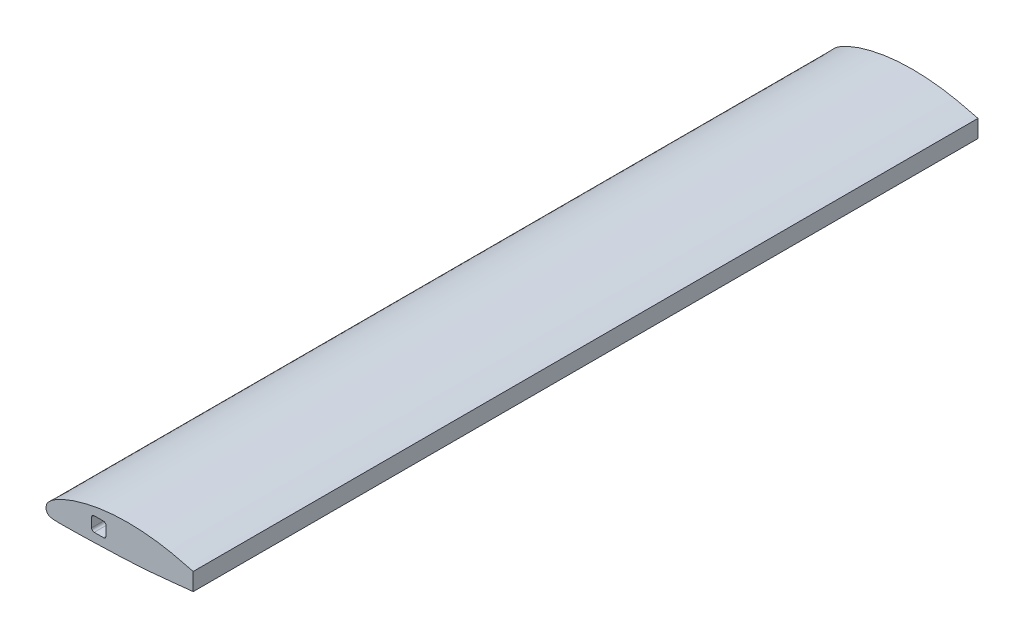
ISO-10303-21;
HEADER;
FILE_DESCRIPTION(('STEP AP214'),'2;1');
FILE_NAME('part.step','',(''),(''),'','','');
FILE_SCHEMA(('AUTOMOTIVE_DESIGN { 1 0 10303 214 1 1 1 1 }'));
ENDSEC;
DATA;
#1=APPLICATION_CONTEXT('core data for automotive mechanical design processes');
#2=APPLICATION_PROTOCOL_DEFINITION('international standard','automotive_design',2000,#1);
#3=PRODUCT_CONTEXT('',#1,'mechanical');
#4=PRODUCT('Part','Part','',(#3));
#5=PRODUCT_RELATED_PRODUCT_CATEGORY('part','',(#4));
#6=PRODUCT_DEFINITION_FORMATION('','',#4);
#7=PRODUCT_DEFINITION_CONTEXT('part definition',#1,'design');
#8=PRODUCT_DEFINITION('design','',#6,#7);
#9=PRODUCT_DEFINITION_SHAPE('','',#8);
#10=(LENGTH_UNIT() NAMED_UNIT(*) SI_UNIT(.MILLI.,.METRE.));
#11=(NAMED_UNIT(*) PLANE_ANGLE_UNIT() SI_UNIT($,.RADIAN.));
#12=(NAMED_UNIT(*) SI_UNIT($,.STERADIAN.) SOLID_ANGLE_UNIT());
#13=UNCERTAINTY_MEASURE_WITH_UNIT(LENGTH_MEASURE(1.E-05),#10,'distance_accuracy_value','');
#14=(GEOMETRIC_REPRESENTATION_CONTEXT(3) GLOBAL_UNCERTAINTY_ASSIGNED_CONTEXT((#13)) GLOBAL_UNIT_ASSIGNED_CONTEXT((#10,
#11,#12)) REPRESENTATION_CONTEXT('',''));
#15=CARTESIAN_POINT('',(0.,0.,0.));
#16=DIRECTION('',(0.,0.,1.));
#17=DIRECTION('',(1.,0.,0.));
#18=AXIS2_PLACEMENT_3D('',#15,#16,#17);
#19=CARTESIAN_POINT('',(292.1,0.,1557.3248));
#20=DIRECTION('',(1.,0.,0.));
#21=DIRECTION('',(0.,0.,-1.));
#22=AXIS2_PLACEMENT_3D('',#19,#20,#21);
#23=PLANE('',#22);
#24=DIRECTION('',(0.,-1.,0.));
#25=VECTOR('',#24,1.);
#26=CARTESIAN_POINT('',(292.1,0.,0.));
#27=LINE('',#26,#25);
#28=CARTESIAN_POINT('',(292.1,36.0891382653728,0.));
#29=VERTEX_POINT('',#28);
#30=CARTESIAN_POINT('',(292.1,1.33397623361237,0.));
#31=VERTEX_POINT('',#30);
#32=EDGE_CURVE('E222',#29,#31,#27,.T.);
#33=ORIENTED_EDGE('',*,*,#32,.F.);
#34=DIRECTION('',(0.,0.,-1.));
#35=VECTOR('',#34,1.);
#36=CARTESIAN_POINT('',(292.1,36.0891382653728,1557.3248));
#37=LINE('',#36,#35);
#38=CARTESIAN_POINT('',(292.1,36.0891382653728,1557.3248));
#39=VERTEX_POINT('',#38);
#40=EDGE_CURVE('E11',#39,#29,#37,.T.);
#41=ORIENTED_EDGE('',*,*,#40,.F.);
#42=DIRECTION('',(0.,-1.,0.));
#43=VECTOR('',#42,1.);
#44=CARTESIAN_POINT('',(292.1,0.,1557.3248));
#45=LINE('',#44,#43);
#46=CARTESIAN_POINT('',(292.1,1.33397623361237,1557.3248));
#47=VERTEX_POINT('',#46);
#48=EDGE_CURVE('E140',#39,#47,#45,.T.);
#49=ORIENTED_EDGE('',*,*,#48,.T.);
#50=DIRECTION('',(0.,0.,-1.));
#51=VECTOR('',#50,1.);
#52=CARTESIAN_POINT('',(292.1,1.33397623361237,1557.3248));
#53=LINE('',#52,#51);
#54=EDGE_CURVE('E45',#47,#31,#53,.T.);
#55=ORIENTED_EDGE('',*,*,#54,.T.);
#56=EDGE_LOOP('',(#33,#41,#49,#55));
#57=FACE_BOUND('',#56,.T.);
#58=ADVANCED_FACE('F35',(#57),#23,.T.);
#59=CARTESIAN_POINT('',(113.919,28.5109385218788,1557.3248));
#60=DIRECTION('',(0.,0.,-1.));
#61=DIRECTION('',(-1.,0.,0.));
#62=AXIS2_PLACEMENT_3D('',#59,#60,#61);
#63=CYLINDRICAL_SURFACE('',#62,5.08);
#64=CARTESIAN_POINT('',(113.919,28.5109385218788,0.));
#65=DIRECTION('',(0.,0.,1.));
#66=DIRECTION('',(1.,0.,0.));
#67=AXIS2_PLACEMENT_3D('',#64,#65,#66);
#68=CIRCLE('',#67,5.08);
#69=CARTESIAN_POINT('',(118.999,28.5109385218788,0.));
#70=VERTEX_POINT('',#69);
#71=CARTESIAN_POINT('',(113.919,33.5909385218788,0.));
#72=VERTEX_POINT('',#71);
#73=EDGE_CURVE('E151',#70,#72,#68,.T.);
#74=ORIENTED_EDGE('',*,*,#73,.F.);
#75=DIRECTION('',(0.,0.,-1.));
#76=VECTOR('',#75,1.);
#77=CARTESIAN_POINT('',(118.999,28.5109385218788,1557.3248));
#78=LINE('',#77,#76);
#79=CARTESIAN_POINT('',(118.999,28.5109385218788,1557.3248));
#80=VERTEX_POINT('',#79);
#81=EDGE_CURVE('E39',#80,#70,#78,.T.);
#82=ORIENTED_EDGE('',*,*,#81,.F.);
#83=CARTESIAN_POINT('',(113.919,28.5109385218788,1557.3248));
#84=DIRECTION('',(0.,0.,1.));
#85=DIRECTION('',(1.,0.,0.));
#86=AXIS2_PLACEMENT_3D('',#83,#84,#85);
#87=CIRCLE('',#86,5.08);
#88=CARTESIAN_POINT('',(113.919,33.5909385218788,1557.3248));
#89=VERTEX_POINT('',#88);
#90=EDGE_CURVE('E130',#80,#89,#87,.T.);
#91=ORIENTED_EDGE('',*,*,#90,.T.);
#92=DIRECTION('',(0.,0.,-1.));
#93=VECTOR('',#92,1.);
#94=CARTESIAN_POINT('',(113.919,33.5909385218788,1557.3248));
#95=LINE('',#94,#93);
#96=EDGE_CURVE('E120',#89,#72,#95,.T.);
#97=ORIENTED_EDGE('',*,*,#96,.T.);
#98=EDGE_LOOP('',(#74,#82,#91,#97));
#99=FACE_BOUND('',#98,.T.);
#100=ADVANCED_FACE('F37',(#99),#63,.F.);
#101=CARTESIAN_POINT('',(118.999,0.,1557.3248));
#102=DIRECTION('',(1.,0.,0.));
#103=DIRECTION('',(0.,0.,-1.));
#104=AXIS2_PLACEMENT_3D('',#101,#102,#103);
#105=PLANE('',#104);
#106=DIRECTION('',(0.,-1.,0.));
#107=VECTOR('',#106,1.);
#108=CARTESIAN_POINT('',(118.999,0.,0.));
#109=LINE('',#108,#107);
#110=CARTESIAN_POINT('',(118.999,10.2229385218788,0.));
#111=VERTEX_POINT('',#110);
#112=EDGE_CURVE('E194',#70,#111,#109,.T.);
#113=ORIENTED_EDGE('',*,*,#112,.T.);
#114=DIRECTION('',(0.,0.,-1.));
#115=VECTOR('',#114,1.);
#116=CARTESIAN_POINT('',(118.999,10.2229385218788,1557.3248));
#117=LINE('',#116,#115);
#118=CARTESIAN_POINT('',(118.999,10.2229385218788,1557.3248));
#119=VERTEX_POINT('',#118);
#120=EDGE_CURVE('E196',#119,#111,#117,.T.);
#121=ORIENTED_EDGE('',*,*,#120,.F.);
#122=DIRECTION('',(0.,-1.,0.));
#123=VECTOR('',#122,1.);
#124=CARTESIAN_POINT('',(118.999,0.,1557.3248));
#125=LINE('',#124,#123);
#126=EDGE_CURVE('E132',#80,#119,#125,.T.);
#127=ORIENTED_EDGE('',*,*,#126,.F.);
#128=ORIENTED_EDGE('',*,*,#81,.T.);
#129=EDGE_LOOP('',(#113,#121,#127,#128));
#130=FACE_BOUND('',#129,.T.);
#131=ADVANCED_FACE('F185',(#130),#105,.F.);
#132=CARTESIAN_POINT('',(113.919,10.2229385218788,1557.3248));
#133=DIRECTION('',(0.,0.,-1.));
#134=DIRECTION('',(-1.,0.,0.));
#135=AXIS2_PLACEMENT_3D('',#132,#133,#134);
#136=CYLINDRICAL_SURFACE('',#135,5.08);
#137=CARTESIAN_POINT('',(113.919,10.2229385218788,0.));
#138=DIRECTION('',(0.,0.,1.));
#139=DIRECTION('',(1.,0.,0.));
#140=AXIS2_PLACEMENT_3D('',#137,#138,#139);
#141=CIRCLE('',#140,5.08);
#142=CARTESIAN_POINT('',(113.919,5.14293852187881,0.));
#143=VERTEX_POINT('',#142);
#144=EDGE_CURVE('E200',#111,#143,#141,.F.);
#145=ORIENTED_EDGE('',*,*,#144,.T.);
#146=DIRECTION('',(0.,0.,-1.));
#147=VECTOR('',#146,1.);
#148=CARTESIAN_POINT('',(113.919,5.14293852187881,1557.3248));
#149=LINE('',#148,#147);
#150=CARTESIAN_POINT('',(113.919,5.14293852187881,1557.3248));
#151=VERTEX_POINT('',#150);
#152=EDGE_CURVE('E204',#151,#143,#149,.T.);
#153=ORIENTED_EDGE('',*,*,#152,.F.);
#154=CARTESIAN_POINT('',(113.919,10.2229385218788,1557.3248));
#155=DIRECTION('',(0.,0.,1.));
#156=DIRECTION('',(1.,0.,0.));
#157=AXIS2_PLACEMENT_3D('',#154,#155,#156);
#158=CIRCLE('',#157,5.08);
#159=EDGE_CURVE('E203',#119,#151,#158,.F.);
#160=ORIENTED_EDGE('',*,*,#159,.F.);
#161=ORIENTED_EDGE('',*,*,#120,.T.);
#162=EDGE_LOOP('',(#145,#153,#160,#161));
#163=FACE_BOUND('',#162,.T.);
#164=ADVANCED_FACE('F182',(#163),#136,.F.);
#165=CARTESIAN_POINT('',(0.,5.14293852187881,1557.3248));
#166=DIRECTION('',(0.,-1.,0.));
#167=DIRECTION('',(1.,0.,0.));
#168=AXIS2_PLACEMENT_3D('',#165,#166,#167);
#169=PLANE('',#168);
#170=DIRECTION('',(-1.,0.,0.));
#171=VECTOR('',#170,1.);
#172=CARTESIAN_POINT('',(0.,5.14293852187881,0.));
#173=LINE('',#172,#171);
#174=CARTESIAN_POINT('',(95.631,5.14293852187881,0.));
#175=VERTEX_POINT('',#174);
#176=EDGE_CURVE('E209',#143,#175,#173,.T.);
#177=ORIENTED_EDGE('',*,*,#176,.T.);
#178=DIRECTION('',(0.,0.,-1.));
#179=VECTOR('',#178,1.);
#180=CARTESIAN_POINT('',(95.631,5.14293852187881,1557.3248));
#181=LINE('',#180,#179);
#182=CARTESIAN_POINT('',(95.631,5.14293852187881,1557.3248));
#183=VERTEX_POINT('',#182);
#184=EDGE_CURVE('E237',#183,#175,#181,.T.);
#185=ORIENTED_EDGE('',*,*,#184,.F.);
#186=DIRECTION('',(-1.,0.,0.));
#187=VECTOR('',#186,1.);
#188=CARTESIAN_POINT('',(0.,5.14293852187881,1557.3248));
#189=LINE('',#188,#187);
#190=EDGE_CURVE('E241',#151,#183,#189,.T.);
#191=ORIENTED_EDGE('',*,*,#190,.F.);
#192=ORIENTED_EDGE('',*,*,#152,.T.);
#193=EDGE_LOOP('',(#177,#185,#191,#192));
#194=FACE_BOUND('',#193,.T.);
#195=ADVANCED_FACE('F178',(#194),#169,.F.);
#196=CARTESIAN_POINT('',(95.631,10.2229385218788,1557.3248));
#197=DIRECTION('',(0.,0.,-1.));
#198=DIRECTION('',(-1.,0.,0.));
#199=AXIS2_PLACEMENT_3D('',#196,#197,#198);
#200=CYLINDRICAL_SURFACE('',#199,5.08);
#201=CARTESIAN_POINT('',(95.631,10.2229385218788,0.));
#202=DIRECTION('',(0.,0.,1.));
#203=DIRECTION('',(1.,0.,0.));
#204=AXIS2_PLACEMENT_3D('',#201,#202,#203);
#205=CIRCLE('',#204,5.08);
#206=CARTESIAN_POINT('',(90.551,10.2229385218788,0.));
#207=VERTEX_POINT('',#206);
#208=EDGE_CURVE('E211',#207,#175,#205,.T.);
#209=ORIENTED_EDGE('',*,*,#208,.F.);
#210=DIRECTION('',(0.,0.,-1.));
#211=VECTOR('',#210,1.);
#212=CARTESIAN_POINT('',(90.551,10.2229385218788,1557.3248));
#213=LINE('',#212,#211);
#214=CARTESIAN_POINT('',(90.551,10.2229385218788,1557.3248));
#215=VERTEX_POINT('',#214);
#216=EDGE_CURVE('E235',#215,#207,#213,.T.);
#217=ORIENTED_EDGE('',*,*,#216,.F.);
#218=CARTESIAN_POINT('',(95.631,10.2229385218788,1557.3248));
#219=DIRECTION('',(0.,0.,1.));
#220=DIRECTION('',(1.,0.,0.));
#221=AXIS2_PLACEMENT_3D('',#218,#219,#220);
#222=CIRCLE('',#221,5.08);
#223=EDGE_CURVE('E244',#215,#183,#222,.T.);
#224=ORIENTED_EDGE('',*,*,#223,.T.);
#225=ORIENTED_EDGE('',*,*,#184,.T.);
#226=EDGE_LOOP('',(#209,#217,#224,#225));
#227=FACE_BOUND('',#226,.T.);
#228=ADVANCED_FACE('F174',(#227),#200,.F.);
#229=CARTESIAN_POINT('',(90.551,0.,1557.3248));
#230=DIRECTION('',(1.,0.,0.));
#231=DIRECTION('',(0.,0.,-1.));
#232=AXIS2_PLACEMENT_3D('',#229,#230,#231);
#233=PLANE('',#232);
#234=DIRECTION('',(0.,-1.,0.));
#235=VECTOR('',#234,1.);
#236=CARTESIAN_POINT('',(90.551,0.,0.));
#237=LINE('',#236,#235);
#238=CARTESIAN_POINT('',(90.551,28.5109385218788,0.));
#239=VERTEX_POINT('',#238);
#240=EDGE_CURVE('E215',#239,#207,#237,.T.);
#241=ORIENTED_EDGE('',*,*,#240,.F.);
#242=DIRECTION('',(0.,0.,-1.));
#243=VECTOR('',#242,1.);
#244=CARTESIAN_POINT('',(90.551,28.5109385218788,1557.3248));
#245=LINE('',#244,#243);
#246=CARTESIAN_POINT('',(90.551,28.5109385218788,1557.3248));
#247=VERTEX_POINT('',#246);
#248=EDGE_CURVE('E233',#247,#239,#245,.T.);
#249=ORIENTED_EDGE('',*,*,#248,.F.);
#250=DIRECTION('',(0.,-1.,0.));
#251=VECTOR('',#250,1.);
#252=CARTESIAN_POINT('',(90.551,0.,1557.3248));
#253=LINE('',#252,#251);
#254=EDGE_CURVE('E143',#247,#215,#253,.T.);
#255=ORIENTED_EDGE('',*,*,#254,.T.);
#256=ORIENTED_EDGE('',*,*,#216,.T.);
#257=EDGE_LOOP('',(#241,#249,#255,#256));
#258=FACE_BOUND('',#257,.T.);
#259=ADVANCED_FACE('F170',(#258),#233,.T.);
#260=CARTESIAN_POINT('',(95.631,28.5109385218788,1557.3248));
#261=DIRECTION('',(0.,0.,-1.));
#262=DIRECTION('',(-1.,0.,0.));
#263=AXIS2_PLACEMENT_3D('',#260,#261,#262);
#264=CYLINDRICAL_SURFACE('',#263,5.08);
#265=CARTESIAN_POINT('',(95.631,28.5109385218788,0.));
#266=DIRECTION('',(0.,0.,1.));
#267=DIRECTION('',(1.,0.,0.));
#268=AXIS2_PLACEMENT_3D('',#265,#266,#267);
#269=CIRCLE('',#268,5.08);
#270=CARTESIAN_POINT('',(95.631,33.5909385218788,0.));
#271=VERTEX_POINT('',#270);
#272=EDGE_CURVE('E218',#271,#239,#269,.T.);
#273=ORIENTED_EDGE('',*,*,#272,.F.);
#274=DIRECTION('',(0.,0.,-1.));
#275=VECTOR('',#274,1.);
#276=CARTESIAN_POINT('',(95.631,33.5909385218788,1557.3248));
#277=LINE('',#276,#275);
#278=CARTESIAN_POINT('',(95.631,33.5909385218788,1557.3248));
#279=VERTEX_POINT('',#278);
#280=EDGE_CURVE('E127',#279,#271,#277,.T.);
#281=ORIENTED_EDGE('',*,*,#280,.F.);
#282=CARTESIAN_POINT('',(95.631,28.5109385218788,1557.3248));
#283=DIRECTION('',(0.,0.,1.));
#284=DIRECTION('',(1.,0.,0.));
#285=AXIS2_PLACEMENT_3D('',#282,#283,#284);
#286=CIRCLE('',#285,5.08);
#287=EDGE_CURVE('E139',#279,#247,#286,.T.);
#288=ORIENTED_EDGE('',*,*,#287,.T.);
#289=ORIENTED_EDGE('',*,*,#248,.T.);
#290=EDGE_LOOP('',(#273,#281,#288,#289));
#291=FACE_BOUND('',#290,.T.);
#292=ADVANCED_FACE('F167',(#291),#264,.F.);
#293=CARTESIAN_POINT('',(0.,33.5909385218788,1557.3248));
#294=DIRECTION('',(0.,-1.,0.));
#295=DIRECTION('',(0.,0.,-1.));
#296=AXIS2_PLACEMENT_3D('',#293,#294,#295);
#297=PLANE('',#296);
#298=DIRECTION('',(-1.,0.,0.));
#299=VECTOR('',#298,1.);
#300=CARTESIAN_POINT('',(0.,33.5909385218788,0.));
#301=LINE('',#300,#299);
#302=EDGE_CURVE('E125',#72,#271,#301,.T.);
#303=ORIENTED_EDGE('',*,*,#302,.F.);
#304=ORIENTED_EDGE('',*,*,#96,.F.);
#305=DIRECTION('',(-1.,0.,0.));
#306=VECTOR('',#305,1.);
#307=CARTESIAN_POINT('',(0.,33.5909385218788,1557.3248));
#308=LINE('',#307,#306);
#309=EDGE_CURVE('E123',#89,#279,#308,.T.);
#310=ORIENTED_EDGE('',*,*,#309,.T.);
#311=ORIENTED_EDGE('',*,*,#280,.T.);
#312=EDGE_LOOP('',(#303,#304,#310,#311));
#313=FACE_BOUND('',#312,.T.);
#314=ADVANCED_FACE('F121',(#313),#297,.T.);
#315=CARTESIAN_POINT('',(419.1,0.,1557.3248));
#316=CARTESIAN_POINT('',(419.135582715604,0.0308317196044877,1557.3248));
#317=CARTESIAN_POINT('',(415.908005576762,1.68017552922438,1557.3248));
#318=CARTESIAN_POINT('',(413.243760321431,2.45449325102642,1557.3248));
#319=CARTESIAN_POINT('',(409.043286393216,3.88399929072975,1557.3248));
#320=CARTESIAN_POINT('',(404.448084399841,5.26468352260066,1557.3248));
#321=CARTESIAN_POINT('',(399.073048504437,6.84672085309653,1557.3248));
#322=CARTESIAN_POINT('',(393.069943473864,8.55383071372093,1557.3248));
#323=CARTESIAN_POINT('',(386.416537762572,10.4125623702694,1557.3248));
#324=CARTESIAN_POINT('',(379.149346257583,12.4152401973134,1557.3248));
#325=CARTESIAN_POINT('',(371.290373604248,14.5663386528226,1557.3248));
#326=CARTESIAN_POINT('',(362.867607833606,16.8600771410093,1557.3248));
#327=CARTESIAN_POINT('',(353.911264701423,19.2970964213392,1557.3248));
#328=CARTESIAN_POINT('',(344.453150457147,21.8730071850554,1557.3248));
#329=CARTESIAN_POINT('',(334.523432326998,24.5698824655877,1557.3248));
#330=CARTESIAN_POINT('',(324.169303454509,27.4216021936468,1557.3248));
#331=CARTESIAN_POINT('',(313.362731470659,30.2499142733887,1557.3248));
#332=CARTESIAN_POINT('',(302.362905014892,33.694567181203,1557.3248));
#333=CARTESIAN_POINT('',(290.812066152157,36.3225036594668,1557.3248));
#334=CARTESIAN_POINT('',(279.147802785444,39.4898304897028,1557.3248));
#335=CARTESIAN_POINT('',(267.18702760258,42.4092459803584,1557.3248));
#336=CARTESIAN_POINT('',(255.034690470087,45.1684284186771,1557.3248));
#337=CARTESIAN_POINT('',(242.721185390446,47.650209376373,1557.3248));
#338=CARTESIAN_POINT('',(230.296228943543,49.8338945911509,1557.3248));
#339=CARTESIAN_POINT('',(217.801864374593,51.6800065771285,1557.3248));
#340=CARTESIAN_POINT('',(205.28400048705,53.175668630729,1557.3248));
#341=CARTESIAN_POINT('',(192.786307767397,54.3071055161748,1557.3248));
#342=CARTESIAN_POINT('',(180.35248832563,55.0551537512211,1557.3248));
#343=CARTESIAN_POINT('',(168.027001927048,55.4190185344547,1557.3248));
#344=CARTESIAN_POINT('',(155.853682433519,55.4157048874246,1557.3248));
#345=CARTESIAN_POINT('',(143.874848820048,55.0431886057995,1557.3248));
#346=CARTESIAN_POINT('',(132.132886757781,54.3128726201629,1557.3248));
#347=CARTESIAN_POINT('',(120.667074019597,53.2411304735398,1557.3248));
#348=CARTESIAN_POINT('',(109.522615963792,51.8022144959764,1557.3248));
#349=CARTESIAN_POINT('',(98.7372141186955,50.0463241889842,1557.3248));
#350=CARTESIAN_POINT('',(88.3471013961049,48.018984454137,1557.3248));
#351=CARTESIAN_POINT('',(78.3889033747344,45.7522950434563,1557.3248));
#352=CARTESIAN_POINT('',(68.8976027410483,43.2760726247493,1557.3248));
#353=CARTESIAN_POINT('',(59.9067725274482,40.6169839418443,1557.3248));
#354=CARTESIAN_POINT('',(51.4478081121291,37.8028434738782,1557.3248));
#355=CARTESIAN_POINT('',(43.5499195166549,34.8620258650089,1557.3248));
#356=CARTESIAN_POINT('',(36.2412767191211,31.8209315950195,1557.3248));
#357=CARTESIAN_POINT('',(29.5472205514253,28.7079086552229,1557.3248));
#358=CARTESIAN_POINT('',(23.4899755011858,25.5532333371454,1557.3248));
#359=CARTESIAN_POINT('',(18.0911782238622,22.3841442181796,1557.3248));
#360=CARTESIAN_POINT('',(13.3658843805296,19.2305326996037,1557.3248));
#361=CARTESIAN_POINT('',(9.3302502078457,16.1138179845186,1557.3248));
#362=CARTESIAN_POINT('',(5.96985195064272,13.0389997626468,1557.3248));
#363=CARTESIAN_POINT('',(3.34519775435926,9.93858431084437,1557.3248));
#364=CARTESIAN_POINT('',(1.18019279694968,6.53570814186339,1557.3248));
#365=CARTESIAN_POINT('',(0.479614476084666,3.07990840614629,1557.3248));
#366=CARTESIAN_POINT('',(-0.173094538194013,-0.266173519096999,1557.3248));
#367=CARTESIAN_POINT('',(0.240253696731487,-3.33294292892219,1557.3248));
#368=CARTESIAN_POINT('',(1.37823066344816,-6.42381349893486,1557.3248));
#369=CARTESIAN_POINT('',(3.22917605316422,-9.15021189114401,1557.3248));
#370=CARTESIAN_POINT('',(5.89603945867697,-11.3206783893859,1557.3248));
#371=CARTESIAN_POINT('',(9.37076014042797,-12.5914230643237,1557.3248));
#372=CARTESIAN_POINT('',(13.453435798726,-13.2083059619907,1557.3248));
#373=CARTESIAN_POINT('',(18.1779423005279,-13.5437135880216,1557.3248));
#374=CARTESIAN_POINT('',(23.5691170669731,-13.7123319803595,1557.3248));
#375=CARTESIAN_POINT('',(29.6182619801359,-13.823243232534,1557.3248));
#376=CARTESIAN_POINT('',(36.3042180587839,-13.6335103430087,1557.3248));
#377=CARTESIAN_POINT('',(43.6073655350185,-13.7495169210751,1557.3248));
#378=CARTESIAN_POINT('',(51.4990776759717,-13.5704792834039,1557.3248));
#379=CARTESIAN_POINT('',(59.9532183473222,-13.4254465725169,1557.3248));
#380=CARTESIAN_POINT('',(68.9395115321997,-13.2237173628326,1557.3248));
#381=CARTESIAN_POINT('',(78.4265430004961,-12.9981677083409,1557.3248));
#382=CARTESIAN_POINT('',(88.3808800346853,-12.7416794666378,1557.3248));
#383=CARTESIAN_POINT('',(98.7673540895394,-12.4570310641555,1557.3248));
#384=CARTESIAN_POINT('',(109.54948172432,-12.140459652531,1557.3248));
#385=CARTESIAN_POINT('',(120.689292624668,-11.7887582713286,1557.3248));
#386=CARTESIAN_POINT('',(132.147836588957,-11.3961109222143,1557.3248));
#387=CARTESIAN_POINT('',(143.884459540584,-10.9535138146728,1557.3248));
#388=CARTESIAN_POINT('',(155.858263106315,-10.4528030476575,1557.3248));
#389=CARTESIAN_POINT('',(168.027206140478,-9.86999068905553,1557.3248));
#390=CARTESIAN_POINT('',(180.347887972849,-9.165777546511,1557.3248));
#391=CARTESIAN_POINT('',(192.776520036076,-8.32898473292583,1557.3248));
#392=CARTESIAN_POINT('',(205.26997993133,-7.36712520311923,1557.3248));
#393=CARTESIAN_POINT('',(217.78370517201,-6.28359723526979,1557.3248));
#394=CARTESIAN_POINT('',(230.27340567155,-5.08810592291552,1557.3248));
#395=CARTESIAN_POINT('',(242.694431579561,-3.80572861400042,1557.3248));
#396=CARTESIAN_POINT('',(255.00369846204,-2.48473779902352,1557.3248));
#397=CARTESIAN_POINT('',(267.1595145786,-1.18392896216685,1557.3248));
#398=CARTESIAN_POINT('',(279.118910189508,0.0608541103189656,1557.3248));
#399=CARTESIAN_POINT('',(290.839416131453,1.22547415877869,1557.3248));
#400=CARTESIAN_POINT('',(302.279388868877,2.28931437619538,1557.3248));
#401=CARTESIAN_POINT('',(313.398970817434,3.22922123297632,1557.3248));
#402=CARTESIAN_POINT('',(324.158839538699,4.03315524687126,1557.3248));
#403=CARTESIAN_POINT('',(334.521417810108,4.68459136287556,1557.3248));
#404=CARTESIAN_POINT('',(344.449906703923,5.17915941725161,1557.3248));
#405=CARTESIAN_POINT('',(353.909457193007,5.50145282981024,1557.3248));
#406=CARTESIAN_POINT('',(362.866468874944,5.68255660990501,1557.3248));
#407=CARTESIAN_POINT('',(371.289861146006,5.66136185236058,1557.3248));
#408=CARTESIAN_POINT('',(379.150044793554,5.50730755128629,1557.3248));
#409=CARTESIAN_POINT('',(386.41801209807,5.19545299038324,1557.3248));
#410=CARTESIAN_POINT('',(393.072269135646,4.74663009471408,1557.3248));
#411=CARTESIAN_POINT('',(399.076807101172,4.17945925926168,1557.3248));
#412=CARTESIAN_POINT('',(404.450455267835,3.48998403896945,1557.3248));
#413=CARTESIAN_POINT('',(409.051278482858,2.78398441205405,1557.3248));
#414=CARTESIAN_POINT('',(413.236952463653,1.83700723232058,1557.3248));
#415=CARTESIAN_POINT('',(415.921101733839,1.37110704301137,1557.3248));
#416=CARTESIAN_POINT('',(419.065830525278,-0.029607174319721,1557.3248));
#417=CARTESIAN_POINT('',(419.1,0.,1557.3248));
#418=B_SPLINE_CURVE_WITH_KNOTS('',3,(#315,#316,#317,#318,#319,#320,#321,#322,#323,#324,#325,
#326,#327,#328,#329,#330,#331,#332,#333,#334,#335,#336,#337,#338,#339,#340,#341,#342,#343,#344,
#345,#346,#347,#348,#349,#350,#351,#352,#353,#354,#355,#356,#357,#358,#359,#360,#361,#362,#363,
#364,#365,#366,#367,#368,#369,#370,#371,#372,#373,#374,#375,#376,#377,#378,#379,#380,#381,#382,
#383,#384,#385,#386,#387,#388,#389,#390,#391,#392,#393,#394,#395,#396,#397,#398,#399,#400,#401,
#402,#403,#404,#405,#406,#407,#408,#409,#410,#411,#412,#413,#414,#415,#416,#417),.UNSPECIFIED.,
.T.,.F.,(4,1,1,1,1,1,1,1,1,1,1,1,1,1,1,1,1,1,1,1,1,1,1,1,1,1,1,1,1,1,1,1,1,1,1,1,1,1,1,1,1,1,1,
1,1,1,1,1,1,1,1,1,1,1,1,1,1,1,1,1,1,1,1,1,1,1,1,1,1,1,1,1,1,1,1,1,1,1,1,1,1,1,1,1,1,1,1,1,1,1,1,
1,1,1,1,1,1,1,1,1,4),(0.,0.00326326473849562,0.00725055778081695,0.0120517866669423,
0.0176623330327685,0.0240683135255837,0.0312496964611172,0.0391846495195136,0.0478476383038653,
0.0572106956853794,0.0672423330052171,0.0779087597757613,0.0891739845115157,0.100998598535301,
0.113341295445461,0.126157183269471,0.139462308480939,0.15301104004999,0.166927614873976,
0.181081999654676,0.195404479567021,0.209838051098696,0.22433260533195,0.238841948726956,
0.253325072610518,0.267739981910177,0.282048685133404,0.296212776873056,0.310196042923521,
0.323962314217842,0.337476234648746,0.350702494836571,0.363610632106416,0.376163958841249,
0.388325705275646,0.400058825783343,0.411327389676265,0.422098222191528,0.43233946020634,
0.442020270803025,0.451113162537921,0.459592207108775,0.467434958693347,0.474622153537792,
0.481140130111015,0.486983093720853,0.492171114209171,0.496782496001346,0.500970225910245,
0.505871632390465,0.508789423353898,0.512670174112342,0.516325667709443,0.520069901737776,
0.523879651231969,0.52796074283848,0.532641784179838,0.53806925539385,0.544264221299989,
0.551214848194982,0.558899644744671,0.567291448215615,0.576362098792024,0.586079537161936,
0.59640911206805,0.607314709370189,0.618758331538551,0.630699137504577,0.643094929182506,
0.655903572744297,0.669079202119925,0.682576600267353,0.696348372587692,0.710348009169474,
0.724529115657972,0.738844326830719,0.753243364933569,0.767678182352391,0.782097111011908,
0.796448880119002,0.810678262943487,0.824728612910585,0.838547558662397,0.852083943216766,
0.865287848030887,0.878111787127333,0.890511304117214,0.902443005266515,0.913865891429004,
0.924742045614225,0.935035830895632,0.944714495449492,0.953747111862331,0.962105881416277,
0.969765452086777,0.97670305026236,0.982898839006144,0.988333205705569,0.992993711919812,
0.996866342545812,1.),.UNSPECIFIED.);
#419=DIRECTION('',(0.,0.,-1.));
#420=VECTOR('',#419,1.);
#421=SURFACE_OF_LINEAR_EXTRUSION('',#418,#420);
#422=CARTESIAN_POINT('',(419.1,0.,0.));
#423=CARTESIAN_POINT('',(419.135582715604,0.0308317196044877,0.));
#424=CARTESIAN_POINT('',(415.908005576762,1.68017552922438,0.));
#425=CARTESIAN_POINT('',(413.243760321431,2.45449325102642,0.));
#426=CARTESIAN_POINT('',(409.043286393216,3.88399929072975,0.));
#427=CARTESIAN_POINT('',(404.448084399841,5.26468352260066,0.));
#428=CARTESIAN_POINT('',(399.073048504437,6.84672085309653,0.));
#429=CARTESIAN_POINT('',(393.069943473864,8.55383071372093,0.));
#430=CARTESIAN_POINT('',(386.416537762572,10.4125623702694,0.));
#431=CARTESIAN_POINT('',(379.149346257583,12.4152401973134,0.));
#432=CARTESIAN_POINT('',(371.290373604248,14.5663386528226,0.));
#433=CARTESIAN_POINT('',(362.867607833606,16.8600771410093,0.));
#434=CARTESIAN_POINT('',(353.911264701423,19.2970964213392,0.));
#435=CARTESIAN_POINT('',(344.453150457147,21.8730071850554,0.));
#436=CARTESIAN_POINT('',(334.523432326998,24.5698824655877,0.));
#437=CARTESIAN_POINT('',(324.169303454509,27.4216021936468,0.));
#438=CARTESIAN_POINT('',(313.362731470659,30.2499142733887,0.));
#439=CARTESIAN_POINT('',(302.362905014892,33.694567181203,0.));
#440=CARTESIAN_POINT('',(290.812066152157,36.3225036594668,0.));
#441=CARTESIAN_POINT('',(279.147802785444,39.4898304897028,0.));
#442=CARTESIAN_POINT('',(267.18702760258,42.4092459803584,0.));
#443=CARTESIAN_POINT('',(255.034690470087,45.1684284186771,0.));
#444=CARTESIAN_POINT('',(242.721185390446,47.650209376373,0.));
#445=CARTESIAN_POINT('',(230.296228943543,49.8338945911509,0.));
#446=CARTESIAN_POINT('',(217.801864374593,51.6800065771285,0.));
#447=CARTESIAN_POINT('',(205.28400048705,53.175668630729,0.));
#448=CARTESIAN_POINT('',(192.786307767397,54.3071055161748,0.));
#449=CARTESIAN_POINT('',(180.35248832563,55.0551537512211,0.));
#450=CARTESIAN_POINT('',(168.027001927048,55.4190185344547,0.));
#451=CARTESIAN_POINT('',(155.853682433519,55.4157048874246,0.));
#452=CARTESIAN_POINT('',(143.874848820048,55.0431886057995,0.));
#453=CARTESIAN_POINT('',(132.132886757781,54.3128726201629,0.));
#454=CARTESIAN_POINT('',(120.667074019597,53.2411304735398,0.));
#455=CARTESIAN_POINT('',(109.522615963792,51.8022144959764,0.));
#456=CARTESIAN_POINT('',(98.7372141186955,50.0463241889842,0.));
#457=CARTESIAN_POINT('',(88.3471013961049,48.018984454137,0.));
#458=CARTESIAN_POINT('',(78.3889033747344,45.7522950434563,0.));
#459=CARTESIAN_POINT('',(68.8976027410483,43.2760726247493,0.));
#460=CARTESIAN_POINT('',(59.9067725274482,40.6169839418443,0.));
#461=CARTESIAN_POINT('',(51.4478081121291,37.8028434738782,0.));
#462=CARTESIAN_POINT('',(43.5499195166549,34.8620258650089,0.));
#463=CARTESIAN_POINT('',(36.2412767191211,31.8209315950195,0.));
#464=CARTESIAN_POINT('',(29.5472205514253,28.7079086552229,0.));
#465=CARTESIAN_POINT('',(23.4899755011858,25.5532333371454,0.));
#466=CARTESIAN_POINT('',(18.0911782238622,22.3841442181796,0.));
#467=CARTESIAN_POINT('',(13.3658843805296,19.2305326996037,0.));
#468=CARTESIAN_POINT('',(9.3302502078457,16.1138179845186,0.));
#469=CARTESIAN_POINT('',(5.96985195064272,13.0389997626468,0.));
#470=CARTESIAN_POINT('',(3.34519775435926,9.93858431084437,0.));
#471=CARTESIAN_POINT('',(1.18019279694968,6.53570814186339,0.));
#472=CARTESIAN_POINT('',(0.479614476084666,3.07990840614629,0.));
#473=CARTESIAN_POINT('',(-0.173094538194013,-0.266173519096999,0.));
#474=CARTESIAN_POINT('',(0.240253696731487,-3.33294292892219,0.));
#475=CARTESIAN_POINT('',(1.37823066344816,-6.42381349893486,0.));
#476=CARTESIAN_POINT('',(3.22917605316422,-9.15021189114401,0.));
#477=CARTESIAN_POINT('',(5.89603945867697,-11.3206783893859,0.));
#478=CARTESIAN_POINT('',(9.37076014042797,-12.5914230643237,0.));
#479=CARTESIAN_POINT('',(13.453435798726,-13.2083059619907,0.));
#480=CARTESIAN_POINT('',(18.1779423005279,-13.5437135880216,0.));
#481=CARTESIAN_POINT('',(23.5691170669731,-13.7123319803595,0.));
#482=CARTESIAN_POINT('',(29.6182619801359,-13.823243232534,0.));
#483=CARTESIAN_POINT('',(36.3042180587839,-13.6335103430087,0.));
#484=CARTESIAN_POINT('',(43.6073655350185,-13.7495169210751,0.));
#485=CARTESIAN_POINT('',(51.4990776759717,-13.5704792834039,0.));
#486=CARTESIAN_POINT('',(59.9532183473222,-13.4254465725169,0.));
#487=CARTESIAN_POINT('',(68.9395115321997,-13.2237173628326,0.));
#488=CARTESIAN_POINT('',(78.4265430004961,-12.9981677083409,0.));
#489=CARTESIAN_POINT('',(88.3808800346853,-12.7416794666378,0.));
#490=CARTESIAN_POINT('',(98.7673540895394,-12.4570310641555,0.));
#491=CARTESIAN_POINT('',(109.54948172432,-12.140459652531,0.));
#492=CARTESIAN_POINT('',(120.689292624668,-11.7887582713286,0.));
#493=CARTESIAN_POINT('',(132.147836588957,-11.3961109222143,0.));
#494=CARTESIAN_POINT('',(143.884459540584,-10.9535138146728,0.));
#495=CARTESIAN_POINT('',(155.858263106315,-10.4528030476575,0.));
#496=CARTESIAN_POINT('',(168.027206140478,-9.86999068905553,0.));
#497=CARTESIAN_POINT('',(180.347887972849,-9.165777546511,0.));
#498=CARTESIAN_POINT('',(192.776520036076,-8.32898473292583,0.));
#499=CARTESIAN_POINT('',(205.26997993133,-7.36712520311923,0.));
#500=CARTESIAN_POINT('',(217.78370517201,-6.28359723526979,0.));
#501=CARTESIAN_POINT('',(230.27340567155,-5.08810592291552,0.));
#502=CARTESIAN_POINT('',(242.694431579561,-3.80572861400042,0.));
#503=CARTESIAN_POINT('',(255.00369846204,-2.48473779902352,0.));
#504=CARTESIAN_POINT('',(267.1595145786,-1.18392896216685,0.));
#505=CARTESIAN_POINT('',(279.118910189508,0.0608541103189656,0.));
#506=CARTESIAN_POINT('',(290.839416131453,1.22547415877869,0.));
#507=CARTESIAN_POINT('',(302.279388868877,2.28931437619538,0.));
#508=CARTESIAN_POINT('',(313.398970817434,3.22922123297632,0.));
#509=CARTESIAN_POINT('',(324.158839538699,4.03315524687126,0.));
#510=CARTESIAN_POINT('',(334.521417810108,4.68459136287556,0.));
#511=CARTESIAN_POINT('',(344.449906703923,5.17915941725161,0.));
#512=CARTESIAN_POINT('',(353.909457193007,5.50145282981024,0.));
#513=CARTESIAN_POINT('',(362.866468874944,5.68255660990501,0.));
#514=CARTESIAN_POINT('',(371.289861146006,5.66136185236058,0.));
#515=CARTESIAN_POINT('',(379.150044793554,5.50730755128629,0.));
#516=CARTESIAN_POINT('',(386.41801209807,5.19545299038324,0.));
#517=CARTESIAN_POINT('',(393.072269135646,4.74663009471408,0.));
#518=CARTESIAN_POINT('',(399.076807101172,4.17945925926168,0.));
#519=CARTESIAN_POINT('',(404.450455267835,3.48998403896945,0.));
#520=CARTESIAN_POINT('',(409.051278482858,2.78398441205405,0.));
#521=CARTESIAN_POINT('',(413.236952463653,1.83700723232058,0.));
#522=CARTESIAN_POINT('',(415.921101733839,1.37110704301137,0.));
#523=CARTESIAN_POINT('',(419.065830525278,-0.029607174319721,0.));
#524=CARTESIAN_POINT('',(419.1,0.,0.));
#525=B_SPLINE_CURVE_WITH_KNOTS('',3,(#422,#423,#424,#425,#426,#427,#428,#429,#430,#431,#432,
#433,#434,#435,#436,#437,#438,#439,#440,#441,#442,#443,#444,#445,#446,#447,#448,#449,#450,#451,
#452,#453,#454,#455,#456,#457,#458,#459,#460,#461,#462,#463,#464,#465,#466,#467,#468,#469,#470,
#471,#472,#473,#474,#475,#476,#477,#478,#479,#480,#481,#482,#483,#484,#485,#486,#487,#488,#489,
#490,#491,#492,#493,#494,#495,#496,#497,#498,#499,#500,#501,#502,#503,#504,#505,#506,#507,#508,
#509,#510,#511,#512,#513,#514,#515,#516,#517,#518,#519,#520,#521,#522,#523,#524),.UNSPECIFIED.,
.T.,.F.,(4,1,1,1,1,1,1,1,1,1,1,1,1,1,1,1,1,1,1,1,1,1,1,1,1,1,1,1,1,1,1,1,1,1,1,1,1,1,1,1,1,1,1,
1,1,1,1,1,1,1,1,1,1,1,1,1,1,1,1,1,1,1,1,1,1,1,1,1,1,1,1,1,1,1,1,1,1,1,1,1,1,1,1,1,1,1,1,1,1,1,1,
1,1,1,1,1,1,1,1,1,4),(0.,0.00326326473849562,0.00725055778081695,0.0120517866669423,
0.0176623330327685,0.0240683135255837,0.0312496964611172,0.0391846495195136,0.0478476383038653,
0.0572106956853794,0.0672423330052171,0.0779087597757613,0.0891739845115157,0.100998598535301,
0.113341295445461,0.126157183269471,0.139462308480939,0.15301104004999,0.166927614873976,
0.181081999654676,0.195404479567021,0.209838051098696,0.22433260533195,0.238841948726956,
0.253325072610518,0.267739981910177,0.282048685133404,0.296212776873056,0.310196042923521,
0.323962314217842,0.337476234648746,0.350702494836571,0.363610632106416,0.376163958841249,
0.388325705275646,0.400058825783343,0.411327389676265,0.422098222191528,0.43233946020634,
0.442020270803025,0.451113162537921,0.459592207108775,0.467434958693347,0.474622153537792,
0.481140130111015,0.486983093720853,0.492171114209171,0.496782496001346,0.500970225910245,
0.505871632390465,0.508789423353898,0.512670174112342,0.516325667709443,0.520069901737776,
0.523879651231969,0.52796074283848,0.532641784179838,0.53806925539385,0.544264221299989,
0.551214848194982,0.558899644744671,0.567291448215615,0.576362098792024,0.586079537161936,
0.59640911206805,0.607314709370189,0.618758331538551,0.630699137504577,0.643094929182506,
0.655903572744297,0.669079202119925,0.682576600267353,0.696348372587692,0.710348009169474,
0.724529115657972,0.738844326830719,0.753243364933569,0.767678182352391,0.782097111011908,
0.796448880119002,0.810678262943487,0.824728612910585,0.838547558662397,0.852083943216766,
0.865287848030887,0.878111787127333,0.890511304117214,0.902443005266515,0.913865891429004,
0.924742045614225,0.935035830895632,0.944714495449492,0.953747111862331,0.962105881416277,
0.969765452086777,0.97670305026236,0.982898839006144,0.988333205705569,0.992993711919812,
0.996866342545812,1.),.UNSPECIFIED.);
#526=EDGE_CURVE('E133',#29,#31,#525,.T.);
#527=ORIENTED_EDGE('',*,*,#526,.T.);
#528=ORIENTED_EDGE('',*,*,#54,.F.);
#529=EDGE_CURVE('E53',#39,#47,#418,.T.);
#530=ORIENTED_EDGE('',*,*,#529,.F.);
#531=ORIENTED_EDGE('',*,*,#40,.T.);
#532=EDGE_LOOP('',(#527,#528,#530,#531));
#533=FACE_BOUND('',#532,.T.);
#534=ADVANCED_FACE('F157',(#533),#421,.F.);
#535=CARTESIAN_POINT('',(0.,0.,1557.3248));
#536=DIRECTION('',(0.,0.,1.));
#537=DIRECTION('',(1.,0.,0.));
#538=AXIS2_PLACEMENT_3D('',#535,#536,#537);
#539=PLANE('',#538);
#540=ORIENTED_EDGE('',*,*,#90,.F.);
#541=ORIENTED_EDGE('',*,*,#126,.T.);
#542=ORIENTED_EDGE('',*,*,#159,.T.);
#543=ORIENTED_EDGE('',*,*,#190,.T.);
#544=ORIENTED_EDGE('',*,*,#223,.F.);
#545=ORIENTED_EDGE('',*,*,#254,.F.);
#546=ORIENTED_EDGE('',*,*,#287,.F.);
#547=ORIENTED_EDGE('',*,*,#309,.F.);
#548=EDGE_LOOP('',(#540,#541,#542,#543,#544,#545,#546,#547));
#549=FACE_BOUND('',#548,.T.);
#550=ORIENTED_EDGE('',*,*,#48,.F.);
#551=ORIENTED_EDGE('',*,*,#529,.T.);
#552=EDGE_LOOP('',(#550,#551));
#553=FACE_BOUND('',#552,.T.);
#554=ADVANCED_FACE('F136',(#549,#553),#539,.T.);
#555=CARTESIAN_POINT('',(0.,0.,0.));
#556=DIRECTION('',(0.,0.,1.));
#557=DIRECTION('',(1.,0.,0.));
#558=AXIS2_PLACEMENT_3D('',#555,#556,#557);
#559=PLANE('',#558);
#560=ORIENTED_EDGE('',*,*,#73,.T.);
#561=ORIENTED_EDGE('',*,*,#302,.T.);
#562=ORIENTED_EDGE('',*,*,#272,.T.);
#563=ORIENTED_EDGE('',*,*,#240,.T.);
#564=ORIENTED_EDGE('',*,*,#208,.T.);
#565=ORIENTED_EDGE('',*,*,#176,.F.);
#566=ORIENTED_EDGE('',*,*,#144,.F.);
#567=ORIENTED_EDGE('',*,*,#112,.F.);
#568=EDGE_LOOP('',(#560,#561,#562,#563,#564,#565,#566,#567));
#569=FACE_BOUND('',#568,.T.);
#570=ORIENTED_EDGE('',*,*,#32,.T.);
#571=ORIENTED_EDGE('',*,*,#526,.F.);
#572=EDGE_LOOP('',(#570,#571));
#573=FACE_BOUND('',#572,.T.);
#574=ADVANCED_FACE('F161',(#569,#573),#559,.F.);
#575=CLOSED_SHELL('',(#58,#100,#131,#164,#195,#228,#259,#292,#314,#534,#554,#574));
#576=MANIFOLD_SOLID_BREP('B2',#575);
#577=ADVANCED_BREP_SHAPE_REPRESENTATION('',(#18,#576),#14);
#578=SHAPE_DEFINITION_REPRESENTATION(#9,#577);
ENDSEC;
END-ISO-10303-21;
